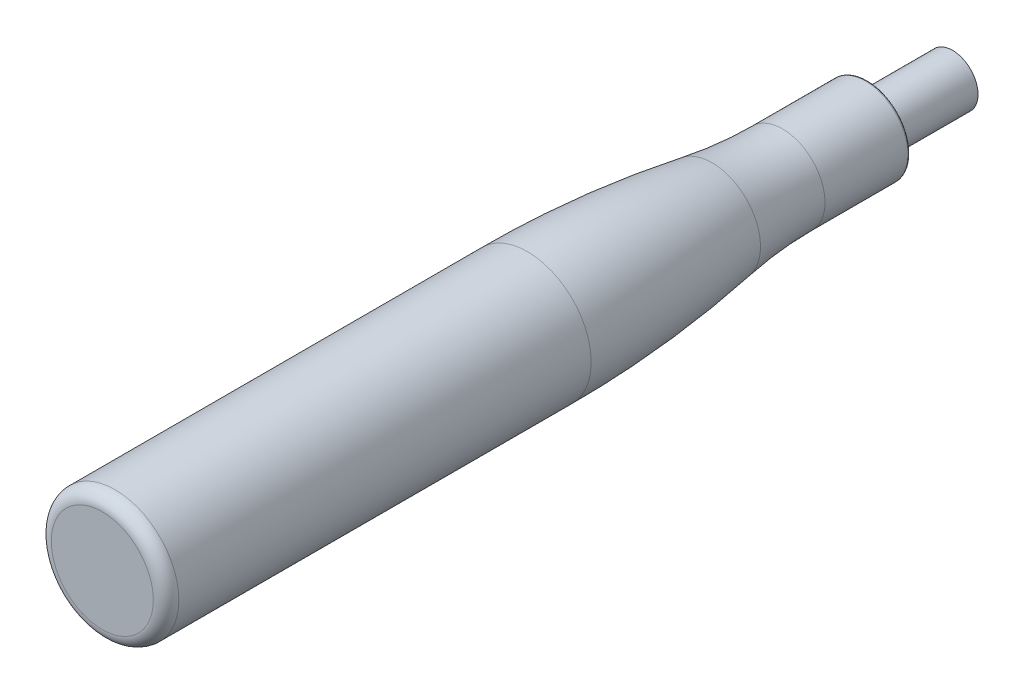
ISO-10303-21;
HEADER;
FILE_DESCRIPTION(('STEP AP214'),'2;1');
FILE_NAME('part.step','',(''),(''),'','','');
FILE_SCHEMA(('AUTOMOTIVE_DESIGN { 1 0 10303 214 1 1 1 1 }'));
ENDSEC;
DATA;
#1=APPLICATION_CONTEXT('core data for automotive mechanical design processes');
#2=APPLICATION_PROTOCOL_DEFINITION('international standard','automotive_design',2000,#1);
#3=PRODUCT_CONTEXT('',#1,'mechanical');
#4=PRODUCT('Part','Part','',(#3));
#5=PRODUCT_RELATED_PRODUCT_CATEGORY('part','',(#4));
#6=PRODUCT_DEFINITION_FORMATION('','',#4);
#7=PRODUCT_DEFINITION_CONTEXT('part definition',#1,'design');
#8=PRODUCT_DEFINITION('design','',#6,#7);
#9=PRODUCT_DEFINITION_SHAPE('','',#8);
#10=(LENGTH_UNIT() NAMED_UNIT(*) SI_UNIT(.MILLI.,.METRE.));
#11=(NAMED_UNIT(*) PLANE_ANGLE_UNIT() SI_UNIT($,.RADIAN.));
#12=(NAMED_UNIT(*) SI_UNIT($,.STERADIAN.) SOLID_ANGLE_UNIT());
#13=UNCERTAINTY_MEASURE_WITH_UNIT(LENGTH_MEASURE(1.E-05),#10,'distance_accuracy_value','');
#14=(GEOMETRIC_REPRESENTATION_CONTEXT(3) GLOBAL_UNCERTAINTY_ASSIGNED_CONTEXT((#13)) GLOBAL_UNIT_ASSIGNED_CONTEXT((#10,
#11,#12)) REPRESENTATION_CONTEXT('',''));
#15=CARTESIAN_POINT('',(0.,0.,0.));
#16=DIRECTION('',(0.,0.,1.));
#17=DIRECTION('',(1.,0.,0.));
#18=AXIS2_PLACEMENT_3D('',#15,#16,#17);
#19=CARTESIAN_POINT('',(0.,0.,90.));
#20=DIRECTION('',(0.,0.,1.));
#21=DIRECTION('',(1.,0.,0.));
#22=AXIS2_PLACEMENT_3D('',#19,#20,#21);
#23=PLANE('',#22);
#24=CARTESIAN_POINT('',(0.,0.,90.));
#25=DIRECTION('',(0.,0.,1.));
#26=DIRECTION('',(1.,0.,0.));
#27=AXIS2_PLACEMENT_3D('',#24,#25,#26);
#28=CIRCLE('',#27,5.99999999999998);
#29=CARTESIAN_POINT('',(5.99999999999998,0.,90.));
#30=VERTEX_POINT('',#29);
#31=EDGE_CURVE('E43',#30,#30,#28,.T.);
#32=ORIENTED_EDGE('',*,*,#31,.T.);
#33=EDGE_LOOP('',(#32));
#34=FACE_BOUND('',#33,.T.);
#35=ADVANCED_FACE('F32',(#34),#23,.T.);
#36=CARTESIAN_POINT('',(0.,0.,-10.));
#37=DIRECTION('',(0.,0.,-1.));
#38=DIRECTION('',(-1.,0.,0.));
#39=AXIS2_PLACEMENT_3D('',#36,#37,#38);
#40=PLANE('',#39);
#41=CARTESIAN_POINT('',(0.,0.,-9.99999999999999));
#42=DIRECTION('',(0.,0.,-1.));
#43=DIRECTION('',(-1.,0.,0.));
#44=AXIS2_PLACEMENT_3D('',#41,#42,#43);
#45=CIRCLE('',#44,2.99999999999999);
#46=CARTESIAN_POINT('',(-2.99999999999999,0.,-9.99999999999999));
#47=VERTEX_POINT('',#46);
#48=EDGE_CURVE('E52',#47,#47,#45,.T.);
#49=ORIENTED_EDGE('',*,*,#48,.T.);
#50=EDGE_LOOP('',(#49));
#51=FACE_BOUND('',#50,.T.);
#52=ADVANCED_FACE('F84',(#51),#40,.T.);
#53=CARTESIAN_POINT('',(0.,0.,-121.417180302296));
#54=DIRECTION('',(0.,0.,-1.));
#55=DIRECTION('',(-1.,0.,0.));
#56=AXIS2_PLACEMENT_3D('',#53,#54,#55);
#57=CYLINDRICAL_SURFACE('',#56,2.99999999999999);
#58=CARTESIAN_POINT('',(0.,0.,0.));
#59=DIRECTION('',(0.,0.,-1.));
#60=DIRECTION('',(-1.,0.,0.));
#61=AXIS2_PLACEMENT_3D('',#58,#59,#60);
#62=CIRCLE('',#61,2.99999999999999);
#63=CARTESIAN_POINT('',(-2.99999999999999,0.,0.));
#64=VERTEX_POINT('',#63);
#65=EDGE_CURVE('E55',#64,#64,#62,.T.);
#66=ORIENTED_EDGE('',*,*,#65,.T.);
#67=EDGE_LOOP('',(#66));
#68=FACE_BOUND('',#67,.T.);
#69=ORIENTED_EDGE('',*,*,#48,.F.);
#70=EDGE_LOOP('',(#69));
#71=FACE_BOUND('',#70,.T.);
#72=ADVANCED_FACE('F90',(#68,#71),#57,.T.);
#73=CARTESIAN_POINT('',(0.,2.99999999999999,0.));
#74=DIRECTION('',(0.,0.,-1.));
#75=DIRECTION('',(-1.,0.,0.));
#76=AXIS2_PLACEMENT_3D('',#73,#74,#75);
#77=PLANE('',#76);
#78=CARTESIAN_POINT('',(0.,0.,0.));
#79=DIRECTION('',(0.,0.,-1.));
#80=DIRECTION('',(-1.,0.,0.));
#81=AXIS2_PLACEMENT_3D('',#78,#79,#80);
#82=CIRCLE('',#81,4.74999999999998);
#83=CARTESIAN_POINT('',(-4.74999999999998,0.,0.));
#84=VERTEX_POINT('',#83);
#85=EDGE_CURVE('E39',#84,#84,#82,.T.);
#86=ORIENTED_EDGE('',*,*,#85,.T.);
#87=EDGE_LOOP('',(#86));
#88=FACE_BOUND('',#87,.T.);
#89=ORIENTED_EDGE('',*,*,#65,.F.);
#90=EDGE_LOOP('',(#89));
#91=FACE_BOUND('',#90,.T.);
#92=ADVANCED_FACE('F96',(#88,#91),#77,.T.);
#93=CARTESIAN_POINT('',(0.,0.,-121.417180302296));
#94=DIRECTION('',(0.,0.,-1.));
#95=DIRECTION('',(-1.,0.,0.));
#96=AXIS2_PLACEMENT_3D('',#93,#94,#95);
#97=CYLINDRICAL_SURFACE('',#96,4.99999999999998);
#98=CARTESIAN_POINT('',(0.,0.,0.249999999999986));
#99=DIRECTION('',(0.,0.,-1.));
#100=DIRECTION('',(-1.,0.,0.));
#101=AXIS2_PLACEMENT_3D('',#98,#99,#100);
#102=CIRCLE('',#101,4.99999999999998);
#103=CARTESIAN_POINT('',(-4.99999999999998,0.,0.249999999999986));
#104=VERTEX_POINT('',#103);
#105=EDGE_CURVE('E10',#104,#104,#102,.F.);
#106=ORIENTED_EDGE('',*,*,#105,.T.);
#107=EDGE_LOOP('',(#106));
#108=FACE_BOUND('',#107,.T.);
#109=CARTESIAN_POINT('',(0.,0.,9.99999999999998));
#110=DIRECTION('',(0.,0.,-1.));
#111=DIRECTION('',(-1.,0.,0.));
#112=AXIS2_PLACEMENT_3D('',#109,#110,#111);
#113=CIRCLE('',#112,4.99999999999998);
#114=CARTESIAN_POINT('',(-4.99999999999998,0.,9.99999999999998));
#115=VERTEX_POINT('',#114);
#116=EDGE_CURVE('E58',#115,#115,#113,.T.);
#117=ORIENTED_EDGE('',*,*,#116,.T.);
#118=EDGE_LOOP('',(#117));
#119=FACE_BOUND('',#118,.T.);
#120=ADVANCED_FACE('F100',(#108,#119),#97,.T.);
#121=CARTESIAN_POINT('',(0.,0.,9.99999999999999));
#122=DIRECTION('',(0.,0.,-1.));
#123=DIRECTION('',(-1.,0.,0.));
#124=AXIS2_PLACEMENT_3D('',#121,#122,#123);
#125=TOROIDAL_SURFACE('',#124,55.,50.);
#126=CARTESIAN_POINT('',(0.,0.,18.2758620689654));
#127=DIRECTION('',(0.,0.,-1.));
#128=DIRECTION('',(-1.,0.,0.));
#129=AXIS2_PLACEMENT_3D('',#126,#127,#128);
#130=CIRCLE('',#129,5.68965517241377);
#131=CARTESIAN_POINT('',(-5.68965517241377,0.,18.2758620689654));
#132=VERTEX_POINT('',#131);
#133=EDGE_CURVE('E61',#132,#132,#130,.T.);
#134=ORIENTED_EDGE('',*,*,#133,.T.);
#135=EDGE_LOOP('',(#134));
#136=FACE_BOUND('',#135,.T.);
#137=ORIENTED_EDGE('',*,*,#116,.F.);
#138=EDGE_LOOP('',(#137));
#139=FACE_BOUND('',#138,.T.);
#140=ADVANCED_FACE('F81',(#136,#139),#125,.F.);
#141=CARTESIAN_POINT('',(0.,0.,39.9999999999999));
#142=DIRECTION('',(0.,0.,-1.));
#143=DIRECTION('',(-1.,0.,0.));
#144=AXIS2_PLACEMENT_3D('',#141,#142,#143);
#145=DEGENERATE_TOROIDAL_SURFACE('',#144,123.75,131.25,.F.);
#146=CARTESIAN_POINT('',(0.,0.,40.));
#147=DIRECTION('',(0.,0.,-1.));
#148=DIRECTION('',(-1.,0.,0.));
#149=AXIS2_PLACEMENT_3D('',#146,#147,#148);
#150=CIRCLE('',#149,7.49999999999998);
#151=CARTESIAN_POINT('',(-7.49999999999998,0.,40.));
#152=VERTEX_POINT('',#151);
#153=EDGE_CURVE('E64',#152,#152,#150,.T.);
#154=ORIENTED_EDGE('',*,*,#153,.T.);
#155=EDGE_LOOP('',(#154));
#156=FACE_BOUND('',#155,.T.);
#157=ORIENTED_EDGE('',*,*,#133,.F.);
#158=EDGE_LOOP('',(#157));
#159=FACE_BOUND('',#158,.T.);
#160=ADVANCED_FACE('F68',(#156,#159),#145,.F.);
#161=CARTESIAN_POINT('',(0.,0.,-121.417180302296));
#162=DIRECTION('',(0.,0.,-1.));
#163=DIRECTION('',(-1.,0.,0.));
#164=AXIS2_PLACEMENT_3D('',#161,#162,#163);
#165=CYLINDRICAL_SURFACE('',#164,7.49999999999998);
#166=CARTESIAN_POINT('',(0.,0.,88.5));
#167=DIRECTION('',(0.,0.,1.));
#168=DIRECTION('',(1.,0.,0.));
#169=AXIS2_PLACEMENT_3D('',#166,#167,#168);
#170=CIRCLE('',#169,7.49999999999998);
#171=CARTESIAN_POINT('',(7.49999999999998,0.,88.5));
#172=VERTEX_POINT('',#171);
#173=EDGE_CURVE('E47',#172,#172,#170,.F.);
#174=ORIENTED_EDGE('',*,*,#173,.T.);
#175=EDGE_LOOP('',(#174));
#176=FACE_BOUND('',#175,.T.);
#177=ORIENTED_EDGE('',*,*,#153,.F.);
#178=EDGE_LOOP('',(#177));
#179=FACE_BOUND('',#178,.T.);
#180=ADVANCED_FACE('F71',(#176,#179),#165,.T.);
#181=CARTESIAN_POINT('',(0.,0.,88.5));
#182=DIRECTION('',(0.,0.,1.));
#183=DIRECTION('',(1.,0.,0.));
#184=AXIS2_PLACEMENT_3D('',#181,#182,#183);
#185=TOROIDAL_SURFACE('',#184,5.99999999999998,1.5);
#186=ORIENTED_EDGE('',*,*,#31,.F.);
#187=EDGE_LOOP('',(#186));
#188=FACE_BOUND('',#187,.T.);
#189=ORIENTED_EDGE('',*,*,#173,.F.);
#190=EDGE_LOOP('',(#189));
#191=FACE_BOUND('',#190,.T.);
#192=ADVANCED_FACE('F73',(#188,#191),#185,.T.);
#193=CARTESIAN_POINT('',(0.,0.,0.249999999999986));
#194=DIRECTION('',(0.,0.,-1.));
#195=DIRECTION('',(-1.,0.,0.));
#196=AXIS2_PLACEMENT_3D('',#193,#194,#195);
#197=TOROIDAL_SURFACE('',#196,4.74999999999998,0.25);
#198=ORIENTED_EDGE('',*,*,#105,.F.);
#199=EDGE_LOOP('',(#198));
#200=FACE_BOUND('',#199,.T.);
#201=ORIENTED_EDGE('',*,*,#85,.F.);
#202=EDGE_LOOP('',(#201));
#203=FACE_BOUND('',#202,.T.);
#204=ADVANCED_FACE('F34',(#200,#203),#197,.T.);
#205=CLOSED_SHELL('',(#35,#52,#72,#92,#120,#140,#160,#180,#192,#204));
#206=MANIFOLD_SOLID_BREP('B2',#205);
#207=ADVANCED_BREP_SHAPE_REPRESENTATION('',(#18,#206),#14);
#208=SHAPE_DEFINITION_REPRESENTATION(#9,#207);
ENDSEC;
END-ISO-10303-21;
